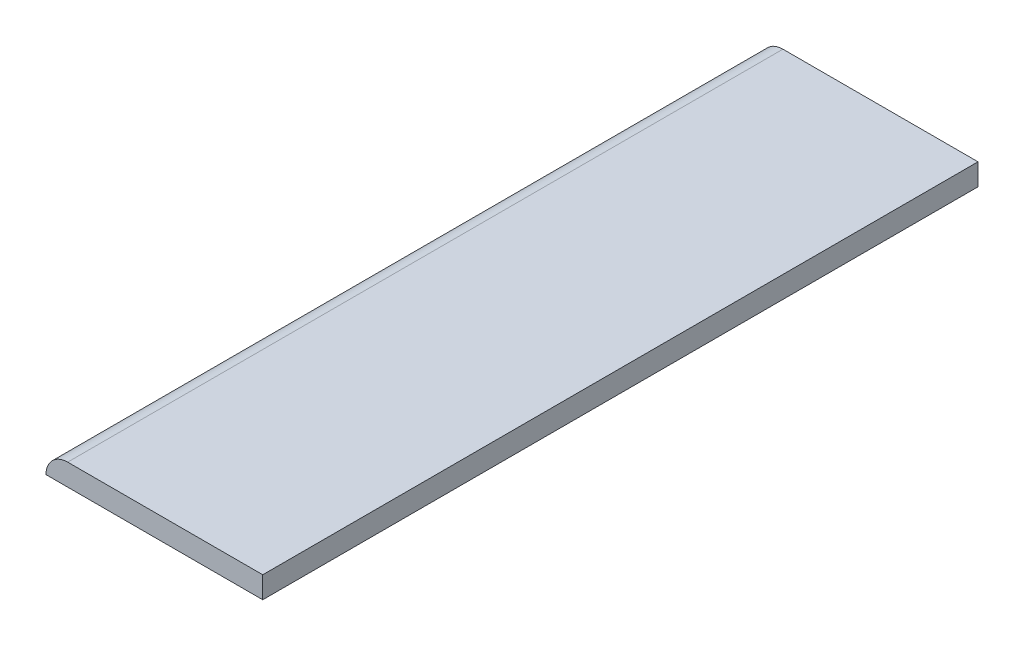
ISO-10303-21;
HEADER;
FILE_DESCRIPTION(('STEP AP214'),'2;1');
FILE_NAME('part.step','',(''),(''),'','','');
FILE_SCHEMA(('AUTOMOTIVE_DESIGN { 1 0 10303 214 1 1 1 1 }'));
ENDSEC;
DATA;
#1=APPLICATION_CONTEXT('core data for automotive mechanical design processes');
#2=APPLICATION_PROTOCOL_DEFINITION('international standard','automotive_design',2000,#1);
#3=PRODUCT_CONTEXT('',#1,'mechanical');
#4=PRODUCT('Part','Part','',(#3));
#5=PRODUCT_RELATED_PRODUCT_CATEGORY('part','',(#4));
#6=PRODUCT_DEFINITION_FORMATION('','',#4);
#7=PRODUCT_DEFINITION_CONTEXT('part definition',#1,'design');
#8=PRODUCT_DEFINITION('design','',#6,#7);
#9=PRODUCT_DEFINITION_SHAPE('','',#8);
#10=(LENGTH_UNIT() NAMED_UNIT(*) SI_UNIT(.MILLI.,.METRE.));
#11=(NAMED_UNIT(*) PLANE_ANGLE_UNIT() SI_UNIT($,.RADIAN.));
#12=(NAMED_UNIT(*) SI_UNIT($,.STERADIAN.) SOLID_ANGLE_UNIT());
#13=UNCERTAINTY_MEASURE_WITH_UNIT(LENGTH_MEASURE(1.E-05),#10,'distance_accuracy_value','');
#14=(GEOMETRIC_REPRESENTATION_CONTEXT(3) GLOBAL_UNCERTAINTY_ASSIGNED_CONTEXT((#13)) GLOBAL_UNIT_ASSIGNED_CONTEXT((#10,
#11,#12)) REPRESENTATION_CONTEXT('',''));
#15=CARTESIAN_POINT('',(0.,0.,0.));
#16=DIRECTION('',(0.,0.,1.));
#17=DIRECTION('',(1.,0.,0.));
#18=AXIS2_PLACEMENT_3D('',#15,#16,#17);
#19=CARTESIAN_POINT('',(18.97,1.62,7.35));
#20=DIRECTION('',(0.,1.,0.));
#21=DIRECTION('',(0.,0.,1.));
#22=AXIS2_PLACEMENT_3D('',#19,#20,#21);
#23=PLANE('',#22);
#24=DIRECTION('',(0.,0.,1.));
#25=VECTOR('',#24,1.);
#26=CARTESIAN_POINT('',(18.97,1.62,5.7));
#27=LINE('',#26,#25);
#28=CARTESIAN_POINT('',(18.97,1.62,7.35));
#29=VERTEX_POINT('',#28);
#30=CARTESIAN_POINT('',(18.97,1.62,4.05));
#31=VERTEX_POINT('',#30);
#32=EDGE_CURVE('E60',#29,#31,#27,.F.);
#33=ORIENTED_EDGE('',*,*,#32,.T.);
#34=DIRECTION('',(-1.,0.,0.));
#35=VECTOR('',#34,1.);
#36=CARTESIAN_POINT('',(18.97,1.62,4.05));
#37=LINE('',#36,#35);
#38=CARTESIAN_POINT('',(18.07,1.62,4.05));
#39=VERTEX_POINT('',#38);
#40=EDGE_CURVE('E83',#39,#31,#37,.F.);
#41=ORIENTED_EDGE('',*,*,#40,.F.);
#42=DIRECTION('',(0.,0.,-1.));
#43=VECTOR('',#42,1.);
#44=CARTESIAN_POINT('',(18.07,1.62,6.525));
#45=LINE('',#44,#43);
#46=CARTESIAN_POINT('',(18.07,1.62,7.35));
#47=VERTEX_POINT('',#46);
#48=EDGE_CURVE('E47',#47,#39,#45,.T.);
#49=ORIENTED_EDGE('',*,*,#48,.F.);
#50=DIRECTION('',(1.,0.,0.));
#51=VECTOR('',#50,1.);
#52=CARTESIAN_POINT('',(18.97,1.62,7.35));
#53=LINE('',#52,#51);
#54=EDGE_CURVE('E55',#29,#47,#53,.F.);
#55=ORIENTED_EDGE('',*,*,#54,.F.);
#56=EDGE_LOOP('',(#33,#41,#49,#55));
#57=FACE_BOUND('',#56,.T.);
#58=ADVANCED_FACE('F17',(#57),#23,.T.);
#59=CARTESIAN_POINT('',(18.97,1.57,5.7));
#60=DIRECTION('',(-1.,0.,0.));
#61=DIRECTION('',(0.,0.,1.));
#62=AXIS2_PLACEMENT_3D('',#59,#60,#61);
#63=PLANE('',#62);
#64=DIRECTION('',(0.,1.,0.));
#65=VECTOR('',#64,1.);
#66=CARTESIAN_POINT('',(18.97,1.62,4.05));
#67=LINE('',#66,#65);
#68=CARTESIAN_POINT('',(18.97,1.52,4.05));
#69=VERTEX_POINT('',#68);
#70=EDGE_CURVE('E66',#31,#69,#67,.F.);
#71=ORIENTED_EDGE('',*,*,#70,.F.);
#72=ORIENTED_EDGE('',*,*,#32,.F.);
#73=DIRECTION('',(0.,1.,0.));
#74=VECTOR('',#73,1.);
#75=CARTESIAN_POINT('',(18.97,1.52,7.35));
#76=LINE('',#75,#74);
#77=CARTESIAN_POINT('',(18.97,1.52,7.35));
#78=VERTEX_POINT('',#77);
#79=EDGE_CURVE('E63',#78,#29,#76,.T.);
#80=ORIENTED_EDGE('',*,*,#79,.F.);
#81=DIRECTION('',(0.,0.,-1.));
#82=VECTOR('',#81,1.);
#83=CARTESIAN_POINT('',(18.97,1.52,4.05));
#84=LINE('',#83,#82);
#85=EDGE_CURVE('E86',#69,#78,#84,.F.);
#86=ORIENTED_EDGE('',*,*,#85,.F.);
#87=EDGE_LOOP('',(#71,#72,#80,#86));
#88=FACE_BOUND('',#87,.T.);
#89=ADVANCED_FACE('F61',(#88),#63,.F.);
#90=CARTESIAN_POINT('',(18.97,1.52,7.35));
#91=DIRECTION('',(0.,0.,1.));
#92=DIRECTION('',(1.,0.,0.));
#93=AXIS2_PLACEMENT_3D('',#90,#91,#92);
#94=PLANE('',#93);
#95=ORIENTED_EDGE('',*,*,#79,.T.);
#96=ORIENTED_EDGE('',*,*,#54,.T.);
#97=CARTESIAN_POINT('',(18.07,1.52,7.35));
#98=DIRECTION('',(0.,0.,-1.));
#99=DIRECTION('',(-1.,0.,0.));
#100=AXIS2_PLACEMENT_3D('',#97,#98,#99);
#101=CIRCLE('',#100,0.1);
#102=CARTESIAN_POINT('',(17.97,1.52,7.35));
#103=VERTEX_POINT('',#102);
#104=EDGE_CURVE('E20',#103,#47,#101,.T.);
#105=ORIENTED_EDGE('',*,*,#104,.F.);
#106=DIRECTION('',(1.,0.,0.));
#107=VECTOR('',#106,1.);
#108=CARTESIAN_POINT('',(18.97,1.52,7.35));
#109=LINE('',#108,#107);
#110=EDGE_CURVE('E73',#78,#103,#109,.F.);
#111=ORIENTED_EDGE('',*,*,#110,.F.);
#112=EDGE_LOOP('',(#95,#96,#105,#111));
#113=FACE_BOUND('',#112,.T.);
#114=ADVANCED_FACE('F71',(#113),#94,.T.);
#115=CARTESIAN_POINT('',(18.07,1.52,6.525));
#116=DIRECTION('',(0.,0.,-1.));
#117=DIRECTION('',(-1.,0.,0.));
#118=AXIS2_PLACEMENT_3D('',#115,#116,#117);
#119=CYLINDRICAL_SURFACE('',#118,0.1);
#120=ORIENTED_EDGE('',*,*,#104,.T.);
#121=ORIENTED_EDGE('',*,*,#48,.T.);
#122=CARTESIAN_POINT('',(18.07,1.52,4.05));
#123=DIRECTION('',(0.,0.,-1.));
#124=DIRECTION('',(-1.,0.,0.));
#125=AXIS2_PLACEMENT_3D('',#122,#123,#124);
#126=CIRCLE('',#125,0.1);
#127=CARTESIAN_POINT('',(17.97,1.52,4.05));
#128=VERTEX_POINT('',#127);
#129=EDGE_CURVE('E35',#128,#39,#126,.T.);
#130=ORIENTED_EDGE('',*,*,#129,.F.);
#131=DIRECTION('',(0.,0.,-1.));
#132=VECTOR('',#131,1.);
#133=CARTESIAN_POINT('',(17.97,1.52,4.05));
#134=LINE('',#133,#132);
#135=EDGE_CURVE('E26',#103,#128,#134,.T.);
#136=ORIENTED_EDGE('',*,*,#135,.F.);
#137=EDGE_LOOP('',(#120,#121,#130,#136));
#138=FACE_BOUND('',#137,.T.);
#139=ADVANCED_FACE('F108',(#138),#119,.T.);
#140=CARTESIAN_POINT('',(18.97,1.62,4.05));
#141=DIRECTION('',(0.,0.,-1.));
#142=DIRECTION('',(-1.,0.,0.));
#143=AXIS2_PLACEMENT_3D('',#140,#141,#142);
#144=PLANE('',#143);
#145=ORIENTED_EDGE('',*,*,#70,.T.);
#146=DIRECTION('',(1.,0.,0.));
#147=VECTOR('',#146,1.);
#148=CARTESIAN_POINT('',(18.97,1.52,4.05));
#149=LINE('',#148,#147);
#150=EDGE_CURVE('E11',#128,#69,#149,.T.);
#151=ORIENTED_EDGE('',*,*,#150,.F.);
#152=ORIENTED_EDGE('',*,*,#129,.T.);
#153=ORIENTED_EDGE('',*,*,#40,.T.);
#154=EDGE_LOOP('',(#145,#151,#152,#153));
#155=FACE_BOUND('',#154,.T.);
#156=ADVANCED_FACE('F106',(#155),#144,.T.);
#157=CARTESIAN_POINT('',(18.97,1.52,4.05));
#158=DIRECTION('',(0.,-1.,0.));
#159=DIRECTION('',(0.,0.,-1.));
#160=AXIS2_PLACEMENT_3D('',#157,#158,#159);
#161=PLANE('',#160);
#162=ORIENTED_EDGE('',*,*,#135,.T.);
#163=ORIENTED_EDGE('',*,*,#150,.T.);
#164=ORIENTED_EDGE('',*,*,#85,.T.);
#165=ORIENTED_EDGE('',*,*,#110,.T.);
#166=EDGE_LOOP('',(#162,#163,#164,#165));
#167=FACE_BOUND('',#166,.T.);
#168=ADVANCED_FACE('F103',(#167),#161,.T.);
#169=CLOSED_SHELL('',(#58,#89,#114,#139,#156,#168));
#170=MANIFOLD_SOLID_BREP('B1',#169);
#171=ADVANCED_BREP_SHAPE_REPRESENTATION('',(#18,#170),#14);
#172=SHAPE_DEFINITION_REPRESENTATION(#9,#171);
ENDSEC;
END-ISO-10303-21;
